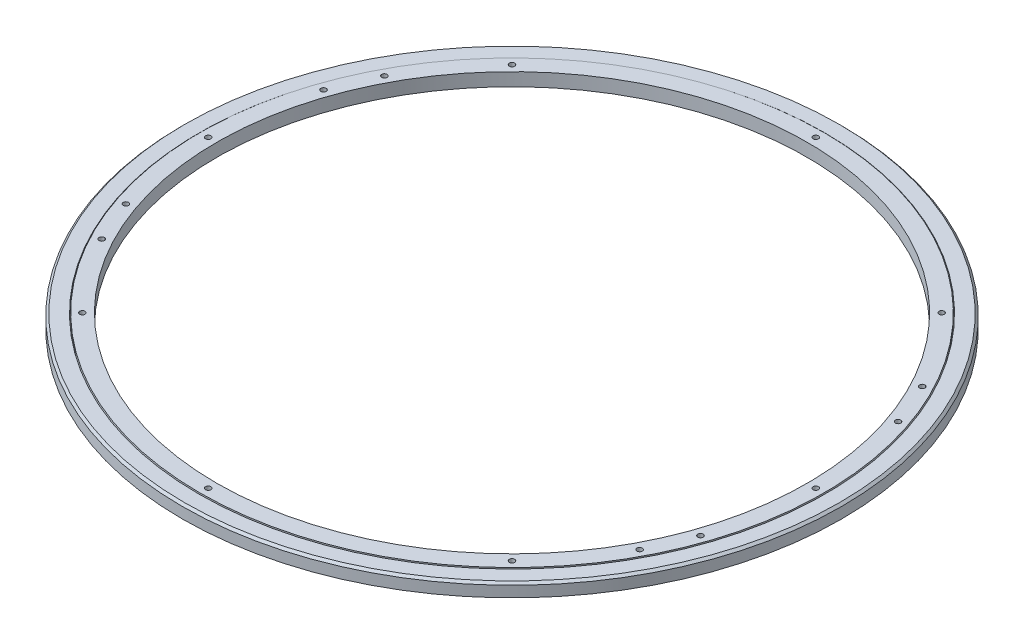
ISO-10303-21;
HEADER;
FILE_DESCRIPTION(('STEP AP214'),'2;1');
FILE_NAME('part.step','',(''),(''),'','','');
FILE_SCHEMA(('AUTOMOTIVE_DESIGN { 1 0 10303 214 1 1 1 1 }'));
ENDSEC;
DATA;
#1=APPLICATION_CONTEXT('core data for automotive mechanical design processes');
#2=APPLICATION_PROTOCOL_DEFINITION('international standard','automotive_design',2000,#1);
#3=PRODUCT_CONTEXT('',#1,'mechanical');
#4=PRODUCT('Part','Part','',(#3));
#5=PRODUCT_RELATED_PRODUCT_CATEGORY('part','',(#4));
#6=PRODUCT_DEFINITION_FORMATION('','',#4);
#7=PRODUCT_DEFINITION_CONTEXT('part definition',#1,'design');
#8=PRODUCT_DEFINITION('design','',#6,#7);
#9=PRODUCT_DEFINITION_SHAPE('','',#8);
#10=(LENGTH_UNIT() NAMED_UNIT(*) SI_UNIT(.MILLI.,.METRE.));
#11=(NAMED_UNIT(*) PLANE_ANGLE_UNIT() SI_UNIT($,.RADIAN.));
#12=(NAMED_UNIT(*) SI_UNIT($,.STERADIAN.) SOLID_ANGLE_UNIT());
#13=UNCERTAINTY_MEASURE_WITH_UNIT(LENGTH_MEASURE(1.E-05),#10,'distance_accuracy_value','');
#14=(GEOMETRIC_REPRESENTATION_CONTEXT(3) GLOBAL_UNCERTAINTY_ASSIGNED_CONTEXT((#13)) GLOBAL_UNIT_ASSIGNED_CONTEXT((#10,
#11,#12)) REPRESENTATION_CONTEXT('',''));
#15=CARTESIAN_POINT('',(0.,0.,0.));
#16=DIRECTION('',(0.,0.,1.));
#17=DIRECTION('',(1.,0.,0.));
#18=AXIS2_PLACEMENT_3D('',#15,#16,#17);
#19=CARTESIAN_POINT('',(0.,11.4758200007945,0.));
#20=DIRECTION('',(0.,1.,0.));
#21=DIRECTION('',(0.,0.,1.));
#22=AXIS2_PLACEMENT_3D('',#19,#20,#21);
#23=CYLINDRICAL_SURFACE('',#22,360.6625);
#24=CARTESIAN_POINT('',(0.,0.,0.));
#25=DIRECTION('',(0.,1.,0.));
#26=DIRECTION('',(0.,0.,1.));
#27=AXIS2_PLACEMENT_3D('',#24,#25,#26);
#28=CIRCLE('',#27,360.6625);
#29=CARTESIAN_POINT('',(0.,0.,360.6625));
#30=VERTEX_POINT('',#29);
#31=EDGE_CURVE('E54',#30,#30,#28,.T.);
#32=ORIENTED_EDGE('',*,*,#31,.T.);
#33=EDGE_LOOP('',(#32));
#34=FACE_BOUND('',#33,.T.);
#35=CARTESIAN_POINT('',(0.,-3.93244185533371,0.));
#36=DIRECTION('',(0.,1.,0.));
#37=DIRECTION('',(0.,0.,1.));
#38=AXIS2_PLACEMENT_3D('',#35,#36,#37);
#39=CIRCLE('',#38,360.6625);
#40=CARTESIAN_POINT('',(0.,-3.93244185533371,360.6625));
#41=VERTEX_POINT('',#40);
#42=EDGE_CURVE('E69',#41,#41,#39,.T.);
#43=ORIENTED_EDGE('',*,*,#42,.F.);
#44=EDGE_LOOP('',(#43));
#45=FACE_BOUND('',#44,.T.);
#46=ADVANCED_FACE('F43',(#34,#45),#23,.F.);
#47=CARTESIAN_POINT('',(-360.6625,0.,0.));
#48=DIRECTION('',(0.,1.,0.));
#49=DIRECTION('',(0.,0.,1.));
#50=AXIS2_PLACEMENT_3D('',#47,#48,#49);
#51=PLANE('',#50);
#52=CARTESIAN_POINT('',(0.,0.,0.));
#53=DIRECTION('',(0.,1.,0.));
#54=DIRECTION('',(0.,0.,1.));
#55=AXIS2_PLACEMENT_3D('',#52,#53,#54);
#56=CIRCLE('',#55,377.4475);
#57=CARTESIAN_POINT('',(0.,0.,377.4475));
#58=VERTEX_POINT('',#57);
#59=EDGE_CURVE('E50',#58,#58,#56,.T.);
#60=ORIENTED_EDGE('',*,*,#59,.T.);
#61=EDGE_LOOP('',(#60));
#62=FACE_BOUND('',#61,.T.);
#63=ORIENTED_EDGE('',*,*,#31,.F.);
#64=EDGE_LOOP('',(#63));
#65=FACE_BOUND('',#64,.T.);
#66=ADVANCED_FACE('F77',(#62,#65),#51,.T.);
#67=CARTESIAN_POINT('',(0.,11.4758200007945,0.));
#68=DIRECTION('',(0.,1.,0.));
#69=DIRECTION('',(0.,0.,1.));
#70=AXIS2_PLACEMENT_3D('',#67,#68,#69);
#71=CYLINDRICAL_SURFACE('',#70,379.9875);
#72=CARTESIAN_POINT('',(0.,-2.53999999999993,0.));
#73=DIRECTION('',(0.,1.,0.));
#74=DIRECTION('',(0.,0.,1.));
#75=AXIS2_PLACEMENT_3D('',#72,#73,#74);
#76=CIRCLE('',#75,379.9875);
#77=CARTESIAN_POINT('',(0.,-2.53999999999993,379.9875));
#78=VERTEX_POINT('',#77);
#79=EDGE_CURVE('E11',#78,#78,#76,.F.);
#80=ORIENTED_EDGE('',*,*,#79,.T.);
#81=EDGE_LOOP('',(#80));
#82=FACE_BOUND('',#81,.T.);
#83=CARTESIAN_POINT('',(0.,-15.08125,0.));
#84=DIRECTION('',(0.,1.,0.));
#85=DIRECTION('',(0.,0.,1.));
#86=AXIS2_PLACEMENT_3D('',#83,#84,#85);
#87=CIRCLE('',#86,379.9875);
#88=CARTESIAN_POINT('',(0.,-15.08125,379.9875));
#89=VERTEX_POINT('',#88);
#90=EDGE_CURVE('E58',#89,#89,#87,.T.);
#91=ORIENTED_EDGE('',*,*,#90,.T.);
#92=EDGE_LOOP('',(#91));
#93=FACE_BOUND('',#92,.T.);
#94=ADVANCED_FACE('F82',(#82,#93),#71,.T.);
#95=CARTESIAN_POINT('',(-360.6625,-15.08125,0.));
#96=DIRECTION('',(0.,-1.,0.));
#97=DIRECTION('',(0.,0.,-1.));
#98=AXIS2_PLACEMENT_3D('',#95,#96,#97);
#99=PLANE('',#98);
#100=CARTESIAN_POINT('',(0.,-15.08125,0.));
#101=DIRECTION('',(0.,1.,0.));
#102=DIRECTION('',(0.,0.,1.));
#103=AXIS2_PLACEMENT_3D('',#100,#101,#102);
#104=CIRCLE('',#103,360.6625);
#105=CARTESIAN_POINT('',(0.,-15.08125,360.6625));
#106=VERTEX_POINT('',#105);
#107=EDGE_CURVE('E63',#106,#106,#104,.T.);
#108=ORIENTED_EDGE('',*,*,#107,.T.);
#109=EDGE_LOOP('',(#108));
#110=FACE_BOUND('',#109,.T.);
#111=ORIENTED_EDGE('',*,*,#90,.F.);
#112=EDGE_LOOP('',(#111));
#113=FACE_BOUND('',#112,.T.);
#114=ADVANCED_FACE('F87',(#110,#113),#99,.T.);
#115=CARTESIAN_POINT('',(0.,11.4758200007945,0.));
#116=DIRECTION('',(0.,1.,0.));
#117=DIRECTION('',(0.,0.,1.));
#118=AXIS2_PLACEMENT_3D('',#115,#116,#117);
#119=CYLINDRICAL_SURFACE('',#118,360.6625);
#120=CARTESIAN_POINT('',(0.,-10.3550581446663,0.));
#121=DIRECTION('',(0.,1.,0.));
#122=DIRECTION('',(0.,0.,1.));
#123=AXIS2_PLACEMENT_3D('',#120,#121,#122);
#124=CIRCLE('',#123,360.6625);
#125=CARTESIAN_POINT('',(0.,-10.3550581446663,360.6625));
#126=VERTEX_POINT('',#125);
#127=EDGE_CURVE('E66',#126,#126,#124,.T.);
#128=ORIENTED_EDGE('',*,*,#127,.T.);
#129=EDGE_LOOP('',(#128));
#130=FACE_BOUND('',#129,.T.);
#131=ORIENTED_EDGE('',*,*,#107,.F.);
#132=EDGE_LOOP('',(#131));
#133=FACE_BOUND('',#132,.T.);
#134=ADVANCED_FACE('F90',(#130,#133),#119,.F.);
#135=CARTESIAN_POINT('',(0.,-7.14374999999999,0.));
#136=DIRECTION('',(0.,1.,0.));
#137=DIRECTION('',(0.,0.,1.));
#138=AXIS2_PLACEMENT_3D('',#135,#136,#137);
#139=TOROIDAL_SURFACE('',#138,360.1625,3.25);
#140=ORIENTED_EDGE('',*,*,#42,.T.);
#141=EDGE_LOOP('',(#140));
#142=FACE_BOUND('',#141,.T.);
#143=ORIENTED_EDGE('',*,*,#127,.F.);
#144=EDGE_LOOP('',(#143));
#145=FACE_BOUND('',#144,.T.);
#146=ADVANCED_FACE('F73',(#142,#145),#139,.F.);
#147=CARTESIAN_POINT('',(0.,0.,0.));
#148=DIRECTION('',(0.,-1.,0.));
#149=DIRECTION('',(0.,0.,-1.));
#150=AXIS2_PLACEMENT_3D('',#147,#148,#149);
#151=CONICAL_SURFACE('',#150,377.4475,0.785398163397448);
#152=ORIENTED_EDGE('',*,*,#79,.F.);
#153=EDGE_LOOP('',(#152));
#154=FACE_BOUND('',#153,.T.);
#155=ORIENTED_EDGE('',*,*,#59,.F.);
#156=EDGE_LOOP('',(#155));
#157=FACE_BOUND('',#156,.T.);
#158=ADVANCED_FACE('F45',(#154,#157),#151,.T.);
#159=CLOSED_SHELL('',(#46,#66,#94,#114,#134,#146,#158));
#160=MANIFOLD_SOLID_BREP('B2',#159);
#161=CARTESIAN_POINT('',(-359.6625,0.793749999999987,0.));
#162=DIRECTION('',(0.,1.,0.));
#163=DIRECTION('',(0.,0.,1.));
#164=AXIS2_PLACEMENT_3D('',#161,#162,#163);
#165=PLANE('',#164);
#166=CARTESIAN_POINT('',(-309.951835338731,0.793750000000015,162.868439780095));
#167=DIRECTION('',(0.,-1.,0.));
#168=DIRECTION('',(0.,0.,-1.));
#169=AXIS2_PLACEMENT_3D('',#166,#167,#168);
#170=CIRCLE('',#169,3.09999999999999);
#171=CARTESIAN_POINT('',(-309.951835338731,0.793750000000015,159.768439780095));
#172=VERTEX_POINT('',#171);
#173=EDGE_CURVE('E292',#172,#172,#170,.T.);
#174=ORIENTED_EDGE('',*,*,#173,.T.);
#175=EDGE_LOOP('',(#174));
#176=FACE_BOUND('',#175,.T.);
#177=CARTESIAN_POINT('',(-331.099210437772,0.793750000000015,113.884071554077));
#178=DIRECTION('',(0.,-1.,0.));
#179=DIRECTION('',(0.,0.,-1.));
#180=AXIS2_PLACEMENT_3D('',#177,#178,#179);
#181=CIRCLE('',#180,3.09999999999999);
#182=CARTESIAN_POINT('',(-331.099210437772,0.793750000000015,110.784071554077));
#183=VERTEX_POINT('',#182);
#184=EDGE_CURVE('E296',#183,#183,#181,.T.);
#185=ORIENTED_EDGE('',*,*,#184,.T.);
#186=EDGE_LOOP('',(#185));
#187=FACE_BOUND('',#186,.T.);
#188=CARTESIAN_POINT('',(309.951835338731,0.793750000000015,162.868439780095));
#189=DIRECTION('',(0.,1.,0.));
#190=DIRECTION('',(0.,0.,-1.));
#191=AXIS2_PLACEMENT_3D('',#188,#189,#190);
#192=CIRCLE('',#191,3.09999999999999);
#193=CARTESIAN_POINT('',(309.951835338731,0.793750000000015,159.768439780095));
#194=VERTEX_POINT('',#193);
#195=EDGE_CURVE('E300',#194,#194,#192,.T.);
#196=ORIENTED_EDGE('',*,*,#195,.F.);
#197=EDGE_LOOP('',(#196));
#198=FACE_BOUND('',#197,.T.);
#199=CARTESIAN_POINT('',(331.099210437772,0.793750000000015,113.884071554077));
#200=DIRECTION('',(0.,1.,0.));
#201=DIRECTION('',(0.,0.,-1.));
#202=AXIS2_PLACEMENT_3D('',#199,#200,#201);
#203=CIRCLE('',#202,3.09999999999999);
#204=CARTESIAN_POINT('',(331.099210437772,0.793750000000015,110.784071554077));
#205=VERTEX_POINT('',#204);
#206=EDGE_CURVE('E304',#205,#205,#203,.T.);
#207=ORIENTED_EDGE('',*,*,#206,.F.);
#208=EDGE_LOOP('',(#207));
#209=FACE_BOUND('',#208,.T.);
#210=CARTESIAN_POINT('',(309.951835338731,0.793750000000015,-162.868439780095));
#211=DIRECTION('',(0.,-1.,0.));
#212=DIRECTION('',(0.,0.,1.));
#213=AXIS2_PLACEMENT_3D('',#210,#211,#212);
#214=CIRCLE('',#213,3.09999999999999);
#215=CARTESIAN_POINT('',(309.951835338731,0.793750000000015,-159.768439780095));
#216=VERTEX_POINT('',#215);
#217=EDGE_CURVE('E308',#216,#216,#214,.T.);
#218=ORIENTED_EDGE('',*,*,#217,.T.);
#219=EDGE_LOOP('',(#218));
#220=FACE_BOUND('',#219,.T.);
#221=CARTESIAN_POINT('',(331.099210437772,0.793750000000015,-113.884071554077));
#222=DIRECTION('',(0.,-1.,0.));
#223=DIRECTION('',(0.,0.,1.));
#224=AXIS2_PLACEMENT_3D('',#221,#222,#223);
#225=CIRCLE('',#224,3.09999999999999);
#226=CARTESIAN_POINT('',(331.099210437772,0.793750000000015,-110.784071554077));
#227=VERTEX_POINT('',#226);
#228=EDGE_CURVE('E312',#227,#227,#225,.T.);
#229=ORIENTED_EDGE('',*,*,#228,.T.);
#230=EDGE_LOOP('',(#229));
#231=FACE_BOUND('',#230,.T.);
#232=CARTESIAN_POINT('',(-309.951835338731,0.793750000000015,-162.868439780095));
#233=DIRECTION('',(0.,1.,0.));
#234=DIRECTION('',(0.,0.,1.));
#235=AXIS2_PLACEMENT_3D('',#232,#233,#234);
#236=CIRCLE('',#235,3.09999999999999);
#237=CARTESIAN_POINT('',(-309.951835338731,0.793750000000015,-159.768439780095));
#238=VERTEX_POINT('',#237);
#239=EDGE_CURVE('E172',#238,#238,#236,.T.);
#240=ORIENTED_EDGE('',*,*,#239,.F.);
#241=EDGE_LOOP('',(#240));
#242=FACE_BOUND('',#241,.T.);
#243=CARTESIAN_POINT('',(-331.099210437772,0.793750000000015,-113.884071554077));
#244=DIRECTION('',(0.,1.,0.));
#245=DIRECTION('',(0.,0.,1.));
#246=AXIS2_PLACEMENT_3D('',#243,#244,#245);
#247=CIRCLE('',#246,3.09999999999999);
#248=CARTESIAN_POINT('',(-331.099210437772,0.793750000000015,-110.784071554077));
#249=VERTEX_POINT('',#248);
#250=EDGE_CURVE('E178',#249,#249,#247,.T.);
#251=ORIENTED_EDGE('',*,*,#250,.F.);
#252=EDGE_LOOP('',(#251));
#253=FACE_BOUND('',#252,.T.);
#254=CARTESIAN_POINT('',(-247.584600597702,0.793749999999987,-247.584600597708));
#255=DIRECTION('',(0.,1.,0.));
#256=DIRECTION('',(0.707106781186539,0.,0.707106781186556));
#257=AXIS2_PLACEMENT_3D('',#254,#255,#256);
#258=CIRCLE('',#257,3.09999999999999);
#259=CARTESIAN_POINT('',(-245.392569576024,0.793749999999987,-245.39256957603));
#260=VERTEX_POINT('',#259);
#261=EDGE_CURVE('E168',#260,#260,#258,.F.);
#262=ORIENTED_EDGE('',*,*,#261,.T.);
#263=EDGE_LOOP('',(#262));
#264=FACE_BOUND('',#263,.T.);
#265=CARTESIAN_POINT('',(-350.1375,0.793749999999987,-3.66749564183756E-12));
#266=DIRECTION('',(0.,1.,0.));
#267=DIRECTION('',(1.,0.,0.));
#268=AXIS2_PLACEMENT_3D('',#265,#266,#267);
#269=CIRCLE('',#268,3.09999999999999);
#270=CARTESIAN_POINT('',(-347.0375,0.793749999999987,-3.63502486538632E-12));
#271=VERTEX_POINT('',#270);
#272=EDGE_CURVE('E213',#271,#271,#269,.F.);
#273=ORIENTED_EDGE('',*,*,#272,.T.);
#274=EDGE_LOOP('',(#273));
#275=FACE_BOUND('',#274,.T.);
#276=CARTESIAN_POINT('',(-247.584600597707,0.793749999999987,247.584600597703));
#277=DIRECTION('',(0.,1.,0.));
#278=DIRECTION('',(0.707106781186554,0.,-0.707106781186541));
#279=AXIS2_PLACEMENT_3D('',#276,#277,#278);
#280=CIRCLE('',#279,3.09999999999999);
#281=CARTESIAN_POINT('',(-245.392569576029,0.793749999999987,245.392569576024));
#282=VERTEX_POINT('',#281);
#283=EDGE_CURVE('E219',#282,#282,#280,.F.);
#284=ORIENTED_EDGE('',*,*,#283,.T.);
#285=EDGE_LOOP('',(#284));
#286=FACE_BOUND('',#285,.T.);
#287=CARTESIAN_POINT('',(-2.44499709455838E-12,0.793749999999987,350.1375));
#288=DIRECTION('',(0.,1.,0.));
#289=DIRECTION('',(0.,0.,-1.));
#290=AXIS2_PLACEMENT_3D('',#287,#288,#289);
#291=CIRCLE('',#290,3.09999999999999);
#292=CARTESIAN_POINT('',(-2.42334991025755E-12,0.793749999999987,347.0375));
#293=VERTEX_POINT('',#292);
#294=EDGE_CURVE('E225',#293,#293,#291,.F.);
#295=ORIENTED_EDGE('',*,*,#294,.T.);
#296=EDGE_LOOP('',(#295));
#297=FACE_BOUND('',#296,.T.);
#298=CARTESIAN_POINT('',(247.584600597704,0.793749999999987,247.584600597706));
#299=DIRECTION('',(0.,1.,0.));
#300=DIRECTION('',(-0.707106781186544,0.,-0.707106781186551));
#301=AXIS2_PLACEMENT_3D('',#298,#299,#300);
#302=CIRCLE('',#301,3.09999999999999);
#303=CARTESIAN_POINT('',(245.392569576025,0.793749999999987,245.392569576028));
#304=VERTEX_POINT('',#303);
#305=EDGE_CURVE('E231',#304,#304,#302,.F.);
#306=ORIENTED_EDGE('',*,*,#305,.T.);
#307=EDGE_LOOP('',(#306));
#308=FACE_BOUND('',#307,.T.);
#309=CARTESIAN_POINT('',(350.1375,0.793749999999987,1.22249854727919E-12));
#310=DIRECTION('',(0.,1.,0.));
#311=DIRECTION('',(-1.,0.,0.));
#312=AXIS2_PLACEMENT_3D('',#309,#310,#311);
#313=CIRCLE('',#312,3.09999999999999);
#314=CARTESIAN_POINT('',(347.0375,0.793749999999987,1.21167495512877E-12));
#315=VERTEX_POINT('',#314);
#316=EDGE_CURVE('E237',#315,#315,#313,.F.);
#317=ORIENTED_EDGE('',*,*,#316,.T.);
#318=EDGE_LOOP('',(#317));
#319=FACE_BOUND('',#318,.T.);
#320=CARTESIAN_POINT('',(247.584600597705,0.793749999999987,-247.584600597704));
#321=DIRECTION('',(0.,1.,0.));
#322=DIRECTION('',(-0.707106781186549,0.,0.707106781186546));
#323=AXIS2_PLACEMENT_3D('',#320,#321,#322);
#324=CIRCLE('',#323,3.09999999999999);
#325=CARTESIAN_POINT('',(245.392569576027,0.793749999999987,-245.392569576026));
#326=VERTEX_POINT('',#325);
#327=EDGE_CURVE('E243',#326,#326,#324,.F.);
#328=ORIENTED_EDGE('',*,*,#327,.T.);
#329=EDGE_LOOP('',(#328));
#330=FACE_BOUND('',#329,.T.);
#331=CARTESIAN_POINT('',(0.,0.793749999999987,-350.1375));
#332=DIRECTION('',(0.,1.,0.));
#333=DIRECTION('',(0.,0.,1.));
#334=AXIS2_PLACEMENT_3D('',#331,#332,#333);
#335=CIRCLE('',#334,3.09999999999999);
#336=CARTESIAN_POINT('',(0.,0.793749999999987,-347.0375));
#337=VERTEX_POINT('',#336);
#338=EDGE_CURVE('E252',#337,#337,#335,.F.);
#339=ORIENTED_EDGE('',*,*,#338,.T.);
#340=EDGE_LOOP('',(#339));
#341=FACE_BOUND('',#340,.T.);
#342=CARTESIAN_POINT('',(0.,0.793750000000015,0.));
#343=DIRECTION('',(0.,1.,0.));
#344=DIRECTION('',(0.,0.,1.));
#345=AXIS2_PLACEMENT_3D('',#342,#343,#344);
#346=CIRCLE('',#345,359.6625);
#347=CARTESIAN_POINT('',(0.,0.793750000000015,359.6625));
#348=VERTEX_POINT('',#347);
#349=EDGE_CURVE('E42',#348,#348,#346,.T.);
#350=ORIENTED_EDGE('',*,*,#349,.T.);
#351=EDGE_LOOP('',(#350));
#352=FACE_BOUND('',#351,.T.);
#353=CARTESIAN_POINT('',(0.,0.793749999999961,0.));
#354=DIRECTION('',(0.,1.,0.));
#355=DIRECTION('',(0.,0.,1.));
#356=AXIS2_PLACEMENT_3D('',#353,#354,#355);
#357=CIRCLE('',#356,340.3375);
#358=CARTESIAN_POINT('',(0.,0.793749999999961,340.3375));
#359=VERTEX_POINT('',#358);
#360=EDGE_CURVE('E255',#359,#359,#357,.T.);
#361=ORIENTED_EDGE('',*,*,#360,.F.);
#362=EDGE_LOOP('',(#361));
#363=FACE_BOUND('',#362,.T.);
#364=ADVANCED_FACE('F150',(#176,#187,#198,#209,#220,#231,#242,#253,#264,#275,#286,#297,#308,
#319,#330,#341,#352,#363),#165,.T.);
#365=CARTESIAN_POINT('',(0.,11.4758200007945,0.));
#366=DIRECTION('',(0.,1.,0.));
#367=DIRECTION('',(0.,0.,1.));
#368=AXIS2_PLACEMENT_3D('',#365,#366,#367);
#369=CYLINDRICAL_SURFACE('',#368,359.6625);
#370=CARTESIAN_POINT('',(0.,-3.9324418553337,0.));
#371=DIRECTION('',(0.,1.,0.));
#372=DIRECTION('',(0.,0.,1.));
#373=AXIS2_PLACEMENT_3D('',#370,#371,#372);
#374=CIRCLE('',#373,359.6625);
#375=CARTESIAN_POINT('',(0.,-3.9324418553337,359.6625));
#376=VERTEX_POINT('',#375);
#377=EDGE_CURVE('E157',#376,#376,#374,.T.);
#378=ORIENTED_EDGE('',*,*,#377,.T.);
#379=EDGE_LOOP('',(#378));
#380=FACE_BOUND('',#379,.T.);
#381=ORIENTED_EDGE('',*,*,#349,.F.);
#382=EDGE_LOOP('',(#381));
#383=FACE_BOUND('',#382,.T.);
#384=ADVANCED_FACE('F281',(#380,#383),#369,.T.);
#385=CARTESIAN_POINT('',(0.,-7.14374999999999,0.));
#386=DIRECTION('',(0.,1.,0.));
#387=DIRECTION('',(0.,0.,1.));
#388=AXIS2_PLACEMENT_3D('',#385,#386,#387);
#389=TOROIDAL_SURFACE('',#388,360.1625,3.24999999999999);
#390=CARTESIAN_POINT('',(0.,-10.3550581446663,0.));
#391=DIRECTION('',(0.,1.,0.));
#392=DIRECTION('',(0.,0.,1.));
#393=AXIS2_PLACEMENT_3D('',#390,#391,#392);
#394=CIRCLE('',#393,359.6625);
#395=CARTESIAN_POINT('',(0.,-10.3550581446663,359.6625));
#396=VERTEX_POINT('',#395);
#397=EDGE_CURVE('E162',#396,#396,#394,.T.);
#398=ORIENTED_EDGE('',*,*,#397,.T.);
#399=EDGE_LOOP('',(#398));
#400=FACE_BOUND('',#399,.T.);
#401=ORIENTED_EDGE('',*,*,#377,.F.);
#402=EDGE_LOOP('',(#401));
#403=FACE_BOUND('',#402,.T.);
#404=ADVANCED_FACE('F266',(#400,#403),#389,.F.);
#405=CARTESIAN_POINT('',(0.,11.4758200007945,0.));
#406=DIRECTION('',(0.,1.,0.));
#407=DIRECTION('',(0.,0.,1.));
#408=AXIS2_PLACEMENT_3D('',#405,#406,#407);
#409=CYLINDRICAL_SURFACE('',#408,359.6625);
#410=CARTESIAN_POINT('',(0.,-14.2875,0.));
#411=DIRECTION('',(0.,1.,0.));
#412=DIRECTION('',(0.,0.,1.));
#413=AXIS2_PLACEMENT_3D('',#410,#411,#412);
#414=CIRCLE('',#413,359.6625);
#415=CARTESIAN_POINT('',(0.,-14.2875,359.6625));
#416=VERTEX_POINT('',#415);
#417=EDGE_CURVE('E261',#416,#416,#414,.T.);
#418=ORIENTED_EDGE('',*,*,#417,.T.);
#419=EDGE_LOOP('',(#418));
#420=FACE_BOUND('',#419,.T.);
#421=ORIENTED_EDGE('',*,*,#397,.F.);
#422=EDGE_LOOP('',(#421));
#423=FACE_BOUND('',#422,.T.);
#424=ADVANCED_FACE('F269',(#420,#423),#409,.T.);
#425=CARTESIAN_POINT('',(-359.6625,-14.2875,0.));
#426=DIRECTION('',(0.,-1.,0.));
#427=DIRECTION('',(0.,0.,-1.));
#428=AXIS2_PLACEMENT_3D('',#425,#426,#427);
#429=PLANE('',#428);
#430=CARTESIAN_POINT('',(-309.951835338731,-14.2875,162.868439780095));
#431=DIRECTION('',(0.,-1.,0.));
#432=DIRECTION('',(0.,0.,-1.));
#433=AXIS2_PLACEMENT_3D('',#430,#431,#432);
#434=CIRCLE('',#433,3.09999999999999);
#435=CARTESIAN_POINT('',(-309.951835338731,-14.2875,159.768439780095));
#436=VERTEX_POINT('',#435);
#437=EDGE_CURVE('E443',#436,#436,#434,.T.);
#438=ORIENTED_EDGE('',*,*,#437,.F.);
#439=EDGE_LOOP('',(#438));
#440=FACE_BOUND('',#439,.T.);
#441=CARTESIAN_POINT('',(-331.099210437772,-14.2875,113.884071554077));
#442=DIRECTION('',(0.,-1.,0.));
#443=DIRECTION('',(0.,0.,-1.));
#444=AXIS2_PLACEMENT_3D('',#441,#442,#443);
#445=CIRCLE('',#444,3.09999999999999);
#446=CARTESIAN_POINT('',(-331.099210437772,-14.2875,110.784071554077));
#447=VERTEX_POINT('',#446);
#448=EDGE_CURVE('E444',#447,#447,#445,.T.);
#449=ORIENTED_EDGE('',*,*,#448,.F.);
#450=EDGE_LOOP('',(#449));
#451=FACE_BOUND('',#450,.T.);
#452=CARTESIAN_POINT('',(309.951835338731,-14.2875,162.868439780095));
#453=DIRECTION('',(0.,1.,0.));
#454=DIRECTION('',(0.,0.,-1.));
#455=AXIS2_PLACEMENT_3D('',#452,#453,#454);
#456=CIRCLE('',#455,3.09999999999999);
#457=CARTESIAN_POINT('',(309.951835338731,-14.2875,159.768439780095));
#458=VERTEX_POINT('',#457);
#459=EDGE_CURVE('E452',#458,#458,#456,.T.);
#460=ORIENTED_EDGE('',*,*,#459,.T.);
#461=EDGE_LOOP('',(#460));
#462=FACE_BOUND('',#461,.T.);
#463=CARTESIAN_POINT('',(331.099210437772,-14.2875,113.884071554077));
#464=DIRECTION('',(0.,1.,0.));
#465=DIRECTION('',(0.,0.,-1.));
#466=AXIS2_PLACEMENT_3D('',#463,#464,#465);
#467=CIRCLE('',#466,3.09999999999999);
#468=CARTESIAN_POINT('',(331.099210437772,-14.2875,110.784071554077));
#469=VERTEX_POINT('',#468);
#470=EDGE_CURVE('E453',#469,#469,#467,.T.);
#471=ORIENTED_EDGE('',*,*,#470,.T.);
#472=EDGE_LOOP('',(#471));
#473=FACE_BOUND('',#472,.T.);
#474=CARTESIAN_POINT('',(309.951835338731,-14.2875,-162.868439780095));
#475=DIRECTION('',(0.,-1.,0.));
#476=DIRECTION('',(0.,0.,1.));
#477=AXIS2_PLACEMENT_3D('',#474,#475,#476);
#478=CIRCLE('',#477,3.09999999999999);
#479=CARTESIAN_POINT('',(309.951835338731,-14.2875,-159.768439780095));
#480=VERTEX_POINT('',#479);
#481=EDGE_CURVE('E183',#480,#480,#478,.T.);
#482=ORIENTED_EDGE('',*,*,#481,.F.);
#483=EDGE_LOOP('',(#482));
#484=FACE_BOUND('',#483,.T.);
#485=CARTESIAN_POINT('',(331.099210437772,-14.2875,-113.884071554077));
#486=DIRECTION('',(0.,-1.,0.));
#487=DIRECTION('',(0.,0.,1.));
#488=AXIS2_PLACEMENT_3D('',#485,#486,#487);
#489=CIRCLE('',#488,3.09999999999999);
#490=CARTESIAN_POINT('',(331.099210437772,-14.2875,-110.784071554077));
#491=VERTEX_POINT('',#490);
#492=EDGE_CURVE('E186',#491,#491,#489,.T.);
#493=ORIENTED_EDGE('',*,*,#492,.F.);
#494=EDGE_LOOP('',(#493));
#495=FACE_BOUND('',#494,.T.);
#496=CARTESIAN_POINT('',(-309.951835338731,-14.2875,-162.868439780095));
#497=DIRECTION('',(0.,-1.,0.));
#498=DIRECTION('',(0.,0.,-1.));
#499=AXIS2_PLACEMENT_3D('',#496,#497,#498);
#500=CIRCLE('',#499,3.09999999999999);
#501=CARTESIAN_POINT('',(-309.951835338731,-14.2875,-165.968439780095));
#502=VERTEX_POINT('',#501);
#503=EDGE_CURVE('E153',#502,#502,#500,.T.);
#504=ORIENTED_EDGE('',*,*,#503,.F.);
#505=EDGE_LOOP('',(#504));
#506=FACE_BOUND('',#505,.T.);
#507=CARTESIAN_POINT('',(-331.099210437772,-14.2875,-113.884071554077));
#508=DIRECTION('',(0.,-1.,0.));
#509=DIRECTION('',(0.,0.,-1.));
#510=AXIS2_PLACEMENT_3D('',#507,#508,#509);
#511=CIRCLE('',#510,3.09999999999999);
#512=CARTESIAN_POINT('',(-331.099210437772,-14.2875,-116.984071554077));
#513=VERTEX_POINT('',#512);
#514=EDGE_CURVE('E170',#513,#513,#511,.T.);
#515=ORIENTED_EDGE('',*,*,#514,.F.);
#516=EDGE_LOOP('',(#515));
#517=FACE_BOUND('',#516,.T.);
#518=CARTESIAN_POINT('',(133.991820299735,-14.2875,-323.484869814669));
#519=DIRECTION('',(0.,-1.,0.));
#520=DIRECTION('',(-1.,0.,0.));
#521=AXIS2_PLACEMENT_3D('',#518,#519,#520);
#522=CIRCLE('',#521,2.35000000000001);
#523=CARTESIAN_POINT('',(131.641820299735,-14.2875,-323.484869814669));
#524=VERTEX_POINT('',#523);
#525=EDGE_CURVE('E176',#524,#524,#522,.T.);
#526=ORIENTED_EDGE('',*,*,#525,.F.);
#527=EDGE_LOOP('',(#526));
#528=FACE_BOUND('',#527,.T.);
#529=CARTESIAN_POINT('',(-323.48486981467,-14.2875,-133.991820299734));
#530=DIRECTION('',(0.,-1.,0.));
#531=DIRECTION('',(0.,0.,1.));
#532=AXIS2_PLACEMENT_3D('',#529,#530,#531);
#533=CIRCLE('',#532,2.35000000000001);
#534=CARTESIAN_POINT('',(-323.48486981467,-14.2875,-131.641820299734));
#535=VERTEX_POINT('',#534);
#536=EDGE_CURVE('E194',#535,#535,#533,.T.);
#537=ORIENTED_EDGE('',*,*,#536,.F.);
#538=EDGE_LOOP('',(#537));
#539=FACE_BOUND('',#538,.T.);
#540=CARTESIAN_POINT('',(-133.991820299733,-14.2875,323.48486981467));
#541=DIRECTION('',(0.,-1.,0.));
#542=DIRECTION('',(1.,0.,0.));
#543=AXIS2_PLACEMENT_3D('',#540,#541,#542);
#544=CIRCLE('',#543,2.35000000000001);
#545=CARTESIAN_POINT('',(-131.641820299733,-14.2875,323.48486981467));
#546=VERTEX_POINT('',#545);
#547=EDGE_CURVE('E200',#546,#546,#544,.T.);
#548=ORIENTED_EDGE('',*,*,#547,.F.);
#549=EDGE_LOOP('',(#548));
#550=FACE_BOUND('',#549,.T.);
#551=CARTESIAN_POINT('',(323.484869814671,-14.2875,133.991820299732));
#552=DIRECTION('',(0.,-1.,0.));
#553=DIRECTION('',(0.,0.,-1.));
#554=AXIS2_PLACEMENT_3D('',#551,#552,#553);
#555=CIRCLE('',#554,2.35000000000001);
#556=CARTESIAN_POINT('',(323.484869814671,-14.2875,131.641820299732));
#557=VERTEX_POINT('',#556);
#558=EDGE_CURVE('E166',#557,#557,#555,.T.);
#559=ORIENTED_EDGE('',*,*,#558,.F.);
#560=EDGE_LOOP('',(#559));
#561=FACE_BOUND('',#560,.T.);
#562=CARTESIAN_POINT('',(-247.584600597702,-14.2875,-247.584600597708));
#563=DIRECTION('',(0.,-1.,0.));
#564=DIRECTION('',(-0.707106781186539,0.,-0.707106781186556));
#565=AXIS2_PLACEMENT_3D('',#562,#563,#564);
#566=CIRCLE('',#565,3.09999999999999);
#567=CARTESIAN_POINT('',(-249.77663161938,-14.2875,-249.776631619386));
#568=VERTEX_POINT('',#567);
#569=EDGE_CURVE('E210',#568,#568,#566,.F.);
#570=ORIENTED_EDGE('',*,*,#569,.T.);
#571=EDGE_LOOP('',(#570));
#572=FACE_BOUND('',#571,.T.);
#573=CARTESIAN_POINT('',(-350.1375,-14.2875,-3.66749564183756E-12));
#574=DIRECTION('',(0.,-1.,0.));
#575=DIRECTION('',(-1.,0.,0.));
#576=AXIS2_PLACEMENT_3D('',#573,#574,#575);
#577=CIRCLE('',#576,3.09999999999999);
#578=CARTESIAN_POINT('',(-353.2375,-14.2875,-3.6999664182888E-12));
#579=VERTEX_POINT('',#578);
#580=EDGE_CURVE('E216',#579,#579,#577,.F.);
#581=ORIENTED_EDGE('',*,*,#580,.T.);
#582=EDGE_LOOP('',(#581));
#583=FACE_BOUND('',#582,.T.);
#584=CARTESIAN_POINT('',(-247.584600597707,-14.2875,247.584600597703));
#585=DIRECTION('',(0.,-1.,0.));
#586=DIRECTION('',(-0.707106781186554,0.,0.707106781186541));
#587=AXIS2_PLACEMENT_3D('',#584,#585,#586);
#588=CIRCLE('',#587,3.09999999999999);
#589=CARTESIAN_POINT('',(-249.776631619385,-14.2875,249.776631619381));
#590=VERTEX_POINT('',#589);
#591=EDGE_CURVE('E222',#590,#590,#588,.F.);
#592=ORIENTED_EDGE('',*,*,#591,.T.);
#593=EDGE_LOOP('',(#592));
#594=FACE_BOUND('',#593,.T.);
#595=CARTESIAN_POINT('',(-2.44499709455838E-12,-14.2875,350.1375));
#596=DIRECTION('',(0.,-1.,0.));
#597=DIRECTION('',(0.,0.,1.));
#598=AXIS2_PLACEMENT_3D('',#595,#596,#597);
#599=CIRCLE('',#598,3.09999999999999);
#600=CARTESIAN_POINT('',(-2.4666442788592E-12,-14.2875,353.2375));
#601=VERTEX_POINT('',#600);
#602=EDGE_CURVE('E228',#601,#601,#599,.F.);
#603=ORIENTED_EDGE('',*,*,#602,.T.);
#604=EDGE_LOOP('',(#603));
#605=FACE_BOUND('',#604,.T.);
#606=CARTESIAN_POINT('',(247.584600597704,-14.2875,247.584600597706));
#607=DIRECTION('',(0.,-1.,0.));
#608=DIRECTION('',(0.707106781186544,0.,0.707106781186551));
#609=AXIS2_PLACEMENT_3D('',#606,#607,#608);
#610=CIRCLE('',#609,3.09999999999999);
#611=CARTESIAN_POINT('',(249.776631619382,-14.2875,249.776631619385));
#612=VERTEX_POINT('',#611);
#613=EDGE_CURVE('E234',#612,#612,#610,.F.);
#614=ORIENTED_EDGE('',*,*,#613,.T.);
#615=EDGE_LOOP('',(#614));
#616=FACE_BOUND('',#615,.T.);
#617=CARTESIAN_POINT('',(350.1375,-14.2875,1.22249854727919E-12));
#618=DIRECTION('',(0.,-1.,0.));
#619=DIRECTION('',(1.,0.,0.));
#620=AXIS2_PLACEMENT_3D('',#617,#618,#619);
#621=CIRCLE('',#620,3.09999999999999);
#622=CARTESIAN_POINT('',(353.2375,-14.2875,1.2333221394296E-12));
#623=VERTEX_POINT('',#622);
#624=EDGE_CURVE('E240',#623,#623,#621,.F.);
#625=ORIENTED_EDGE('',*,*,#624,.T.);
#626=EDGE_LOOP('',(#625));
#627=FACE_BOUND('',#626,.T.);
#628=CARTESIAN_POINT('',(247.584600597705,-14.2875,-247.584600597704));
#629=DIRECTION('',(0.,-1.,0.));
#630=DIRECTION('',(0.707106781186549,0.,-0.707106781186546));
#631=AXIS2_PLACEMENT_3D('',#628,#629,#630);
#632=CIRCLE('',#631,3.09999999999999);
#633=CARTESIAN_POINT('',(249.776631619384,-14.2875,-249.776631619383));
#634=VERTEX_POINT('',#633);
#635=EDGE_CURVE('E246',#634,#634,#632,.F.);
#636=ORIENTED_EDGE('',*,*,#635,.T.);
#637=EDGE_LOOP('',(#636));
#638=FACE_BOUND('',#637,.T.);
#639=CARTESIAN_POINT('',(0.,-14.2875,-350.1375));
#640=DIRECTION('',(0.,-1.,0.));
#641=DIRECTION('',(0.,0.,-1.));
#642=AXIS2_PLACEMENT_3D('',#639,#640,#641);
#643=CIRCLE('',#642,3.09999999999999);
#644=CARTESIAN_POINT('',(0.,-14.2875,-353.2375));
#645=VERTEX_POINT('',#644);
#646=EDGE_CURVE('E249',#645,#645,#643,.F.);
#647=ORIENTED_EDGE('',*,*,#646,.T.);
#648=EDGE_LOOP('',(#647));
#649=FACE_BOUND('',#648,.T.);
#650=CARTESIAN_POINT('',(0.,-14.2875,0.));
#651=DIRECTION('',(0.,1.,0.));
#652=DIRECTION('',(0.,0.,1.));
#653=AXIS2_PLACEMENT_3D('',#650,#651,#652);
#654=CIRCLE('',#653,340.3375);
#655=CARTESIAN_POINT('',(0.,-14.2875,340.3375));
#656=VERTEX_POINT('',#655);
#657=EDGE_CURVE('E258',#656,#656,#654,.T.);
#658=ORIENTED_EDGE('',*,*,#657,.T.);
#659=EDGE_LOOP('',(#658));
#660=FACE_BOUND('',#659,.T.);
#661=ORIENTED_EDGE('',*,*,#417,.F.);
#662=EDGE_LOOP('',(#661));
#663=FACE_BOUND('',#662,.T.);
#664=ADVANCED_FACE('F271',(#440,#451,#462,#473,#484,#495,#506,#517,#528,#539,#550,#561,#572,
#583,#594,#605,#616,#627,#638,#649,#660,#663),#429,.T.);
#665=CARTESIAN_POINT('',(0.,11.4758200007945,0.));
#666=DIRECTION('',(0.,1.,0.));
#667=DIRECTION('',(0.,0.,1.));
#668=AXIS2_PLACEMENT_3D('',#665,#666,#667);
#669=CYLINDRICAL_SURFACE('',#668,340.3375);
#670=ORIENTED_EDGE('',*,*,#360,.T.);
#671=EDGE_LOOP('',(#670));
#672=FACE_BOUND('',#671,.T.);
#673=ORIENTED_EDGE('',*,*,#657,.F.);
#674=EDGE_LOOP('',(#673));
#675=FACE_BOUND('',#674,.T.);
#676=ADVANCED_FACE('F278',(#672,#675),#669,.F.);
#677=CARTESIAN_POINT('',(0.,0.794750000000016,-350.1375));
#678=DIRECTION('',(0.,-1.,0.));
#679=DIRECTION('',(0.,0.,-1.));
#680=AXIS2_PLACEMENT_3D('',#677,#678,#679);
#681=CYLINDRICAL_SURFACE('',#680,3.09999999999999);
#682=ORIENTED_EDGE('',*,*,#338,.F.);
#683=EDGE_LOOP('',(#682));
#684=FACE_BOUND('',#683,.T.);
#685=ORIENTED_EDGE('',*,*,#646,.F.);
#686=EDGE_LOOP('',(#685));
#687=FACE_BOUND('',#686,.T.);
#688=ADVANCED_FACE('F336',(#684,#687),#681,.F.);
#689=CARTESIAN_POINT('',(247.584600597705,0.794750000000016,-247.584600597704));
#690=DIRECTION('',(0.,-1.,0.));
#691=DIRECTION('',(0.707106781186549,0.,-0.707106781186546));
#692=AXIS2_PLACEMENT_3D('',#689,#690,#691);
#693=CYLINDRICAL_SURFACE('',#692,3.09999999999999);
#694=ORIENTED_EDGE('',*,*,#327,.F.);
#695=EDGE_LOOP('',(#694));
#696=FACE_BOUND('',#695,.T.);
#697=ORIENTED_EDGE('',*,*,#635,.F.);
#698=EDGE_LOOP('',(#697));
#699=FACE_BOUND('',#698,.T.);
#700=ADVANCED_FACE('F345',(#696,#699),#693,.F.);
#701=CARTESIAN_POINT('',(350.1375,0.794750000000016,1.22249854727919E-12));
#702=DIRECTION('',(0.,-1.,0.));
#703=DIRECTION('',(1.,0.,0.));
#704=AXIS2_PLACEMENT_3D('',#701,#702,#703);
#705=CYLINDRICAL_SURFACE('',#704,3.09999999999999);
#706=ORIENTED_EDGE('',*,*,#316,.F.);
#707=EDGE_LOOP('',(#706));
#708=FACE_BOUND('',#707,.T.);
#709=ORIENTED_EDGE('',*,*,#624,.F.);
#710=EDGE_LOOP('',(#709));
#711=FACE_BOUND('',#710,.T.);
#712=ADVANCED_FACE('F351',(#708,#711),#705,.F.);
#713=CARTESIAN_POINT('',(247.584600597704,0.794750000000016,247.584600597706));
#714=DIRECTION('',(0.,-1.,0.));
#715=DIRECTION('',(0.707106781186544,0.,0.707106781186551));
#716=AXIS2_PLACEMENT_3D('',#713,#714,#715);
#717=CYLINDRICAL_SURFACE('',#716,3.09999999999999);
#718=ORIENTED_EDGE('',*,*,#305,.F.);
#719=EDGE_LOOP('',(#718));
#720=FACE_BOUND('',#719,.T.);
#721=ORIENTED_EDGE('',*,*,#613,.F.);
#722=EDGE_LOOP('',(#721));
#723=FACE_BOUND('',#722,.T.);
#724=ADVANCED_FACE('F355',(#720,#723),#717,.F.);
#725=CARTESIAN_POINT('',(-2.44499709455838E-12,0.794750000000016,350.1375));
#726=DIRECTION('',(0.,-1.,0.));
#727=DIRECTION('',(0.,0.,1.));
#728=AXIS2_PLACEMENT_3D('',#725,#726,#727);
#729=CYLINDRICAL_SURFACE('',#728,3.09999999999999);
#730=ORIENTED_EDGE('',*,*,#294,.F.);
#731=EDGE_LOOP('',(#730));
#732=FACE_BOUND('',#731,.T.);
#733=ORIENTED_EDGE('',*,*,#602,.F.);
#734=EDGE_LOOP('',(#733));
#735=FACE_BOUND('',#734,.T.);
#736=ADVANCED_FACE('F359',(#732,#735),#729,.F.);
#737=CARTESIAN_POINT('',(-247.584600597707,0.794750000000016,247.584600597703));
#738=DIRECTION('',(0.,-1.,0.));
#739=DIRECTION('',(-0.707106781186554,0.,0.707106781186541));
#740=AXIS2_PLACEMENT_3D('',#737,#738,#739);
#741=CYLINDRICAL_SURFACE('',#740,3.09999999999999);
#742=ORIENTED_EDGE('',*,*,#283,.F.);
#743=EDGE_LOOP('',(#742));
#744=FACE_BOUND('',#743,.T.);
#745=ORIENTED_EDGE('',*,*,#591,.F.);
#746=EDGE_LOOP('',(#745));
#747=FACE_BOUND('',#746,.T.);
#748=ADVANCED_FACE('F363',(#744,#747),#741,.F.);
#749=CARTESIAN_POINT('',(-350.1375,0.794750000000016,-3.66749564183756E-12));
#750=DIRECTION('',(0.,-1.,0.));
#751=DIRECTION('',(-1.,0.,0.));
#752=AXIS2_PLACEMENT_3D('',#749,#750,#751);
#753=CYLINDRICAL_SURFACE('',#752,3.09999999999999);
#754=ORIENTED_EDGE('',*,*,#272,.F.);
#755=EDGE_LOOP('',(#754));
#756=FACE_BOUND('',#755,.T.);
#757=ORIENTED_EDGE('',*,*,#580,.F.);
#758=EDGE_LOOP('',(#757));
#759=FACE_BOUND('',#758,.T.);
#760=ADVANCED_FACE('F367',(#756,#759),#753,.F.);
#761=CARTESIAN_POINT('',(-247.584600597702,0.794750000000016,-247.584600597708));
#762=DIRECTION('',(0.,-1.,0.));
#763=DIRECTION('',(-0.707106781186539,0.,-0.707106781186556));
#764=AXIS2_PLACEMENT_3D('',#761,#762,#763);
#765=CYLINDRICAL_SURFACE('',#764,3.09999999999999);
#766=ORIENTED_EDGE('',*,*,#261,.F.);
#767=EDGE_LOOP('',(#766));
#768=FACE_BOUND('',#767,.T.);
#769=ORIENTED_EDGE('',*,*,#569,.F.);
#770=EDGE_LOOP('',(#769));
#771=FACE_BOUND('',#770,.T.);
#772=ADVANCED_FACE('F371',(#768,#771),#765,.F.);
#773=CARTESIAN_POINT('',(323.484869814671,-15.08125,133.991820299732));
#774=DIRECTION('',(0.,1.,0.));
#775=DIRECTION('',(0.,0.,1.));
#776=AXIS2_PLACEMENT_3D('',#773,#774,#775);
#777=CYLINDRICAL_SURFACE('',#776,2.35000000000001);
#778=ORIENTED_EDGE('',*,*,#558,.T.);
#779=EDGE_LOOP('',(#778));
#780=FACE_BOUND('',#779,.T.);
#781=CARTESIAN_POINT('',(323.484869814671,0.,133.991820299732));
#782=DIRECTION('',(0.,1.,0.));
#783=DIRECTION('',(0.,0.,1.));
#784=AXIS2_PLACEMENT_3D('',#781,#782,#783);
#785=CIRCLE('',#784,2.35000000000001);
#786=CARTESIAN_POINT('',(323.484869814671,0.,136.341820299732));
#787=VERTEX_POINT('',#786);
#788=EDGE_CURVE('E169',#787,#787,#785,.T.);
#789=ORIENTED_EDGE('',*,*,#788,.T.);
#790=EDGE_LOOP('',(#789));
#791=FACE_BOUND('',#790,.T.);
#792=ADVANCED_FACE('F375',(#780,#791),#777,.F.);
#793=CARTESIAN_POINT('',(323.484869814671,0.,133.991820299732));
#794=DIRECTION('',(0.,1.,0.));
#795=DIRECTION('',(0.,0.,1.));
#796=AXIS2_PLACEMENT_3D('',#793,#794,#795);
#797=PLANE('',#796);
#798=ORIENTED_EDGE('',*,*,#788,.F.);
#799=EDGE_LOOP('',(#798));
#800=FACE_BOUND('',#799,.T.);
#801=ADVANCED_FACE('F379',(#800),#797,.F.);
#802=CARTESIAN_POINT('',(-133.991820299733,-15.08125,323.48486981467));
#803=DIRECTION('',(0.,1.,0.));
#804=DIRECTION('',(-1.,0.,0.));
#805=AXIS2_PLACEMENT_3D('',#802,#803,#804);
#806=CYLINDRICAL_SURFACE('',#805,2.35000000000001);
#807=ORIENTED_EDGE('',*,*,#547,.T.);
#808=EDGE_LOOP('',(#807));
#809=FACE_BOUND('',#808,.T.);
#810=CARTESIAN_POINT('',(-133.991820299733,0.,323.48486981467));
#811=DIRECTION('',(0.,1.,0.));
#812=DIRECTION('',(-1.,0.,0.));
#813=AXIS2_PLACEMENT_3D('',#810,#811,#812);
#814=CIRCLE('',#813,2.35000000000001);
#815=CARTESIAN_POINT('',(-136.341820299733,0.,323.48486981467));
#816=VERTEX_POINT('',#815);
#817=EDGE_CURVE('E203',#816,#816,#814,.T.);
#818=ORIENTED_EDGE('',*,*,#817,.T.);
#819=EDGE_LOOP('',(#818));
#820=FACE_BOUND('',#819,.T.);
#821=ADVANCED_FACE('F383',(#809,#820),#806,.F.);
#822=CARTESIAN_POINT('',(-133.991820299733,0.,323.48486981467));
#823=DIRECTION('',(0.,1.,0.));
#824=DIRECTION('',(-1.,0.,0.));
#825=AXIS2_PLACEMENT_3D('',#822,#823,#824);
#826=PLANE('',#825);
#827=ORIENTED_EDGE('',*,*,#817,.F.);
#828=EDGE_LOOP('',(#827));
#829=FACE_BOUND('',#828,.T.);
#830=ADVANCED_FACE('F387',(#829),#826,.F.);
#831=CARTESIAN_POINT('',(-323.48486981467,-15.08125,-133.991820299734));
#832=DIRECTION('',(0.,1.,0.));
#833=DIRECTION('',(0.,0.,-1.));
#834=AXIS2_PLACEMENT_3D('',#831,#832,#833);
#835=CYLINDRICAL_SURFACE('',#834,2.35000000000001);
#836=ORIENTED_EDGE('',*,*,#536,.T.);
#837=EDGE_LOOP('',(#836));
#838=FACE_BOUND('',#837,.T.);
#839=CARTESIAN_POINT('',(-323.48486981467,0.,-133.991820299734));
#840=DIRECTION('',(0.,1.,0.));
#841=DIRECTION('',(0.,0.,-1.));
#842=AXIS2_PLACEMENT_3D('',#839,#840,#841);
#843=CIRCLE('',#842,2.35000000000001);
#844=CARTESIAN_POINT('',(-323.48486981467,0.,-136.341820299734));
#845=VERTEX_POINT('',#844);
#846=EDGE_CURVE('E197',#845,#845,#843,.T.);
#847=ORIENTED_EDGE('',*,*,#846,.T.);
#848=EDGE_LOOP('',(#847));
#849=FACE_BOUND('',#848,.T.);
#850=ADVANCED_FACE('F391',(#838,#849),#835,.F.);
#851=CARTESIAN_POINT('',(-323.48486981467,0.,-133.991820299734));
#852=DIRECTION('',(0.,1.,0.));
#853=DIRECTION('',(0.,0.,-1.));
#854=AXIS2_PLACEMENT_3D('',#851,#852,#853);
#855=PLANE('',#854);
#856=ORIENTED_EDGE('',*,*,#846,.F.);
#857=EDGE_LOOP('',(#856));
#858=FACE_BOUND('',#857,.T.);
#859=ADVANCED_FACE('F395',(#858),#855,.F.);
#860=CARTESIAN_POINT('',(133.991820299735,-15.08125,-323.484869814669));
#861=DIRECTION('',(0.,1.,0.));
#862=DIRECTION('',(1.,0.,0.));
#863=AXIS2_PLACEMENT_3D('',#860,#861,#862);
#864=CYLINDRICAL_SURFACE('',#863,2.35000000000001);
#865=ORIENTED_EDGE('',*,*,#525,.T.);
#866=EDGE_LOOP('',(#865));
#867=FACE_BOUND('',#866,.T.);
#868=CARTESIAN_POINT('',(133.991820299735,0.,-323.484869814669));
#869=DIRECTION('',(0.,1.,0.));
#870=DIRECTION('',(1.,0.,0.));
#871=AXIS2_PLACEMENT_3D('',#868,#869,#870);
#872=CIRCLE('',#871,2.35000000000001);
#873=CARTESIAN_POINT('',(136.341820299735,0.,-323.484869814669));
#874=VERTEX_POINT('',#873);
#875=EDGE_CURVE('E191',#874,#874,#872,.T.);
#876=ORIENTED_EDGE('',*,*,#875,.T.);
#877=EDGE_LOOP('',(#876));
#878=FACE_BOUND('',#877,.T.);
#879=ADVANCED_FACE('F399',(#867,#878),#864,.F.);
#880=CARTESIAN_POINT('',(133.991820299735,0.,-323.484869814669));
#881=DIRECTION('',(0.,1.,0.));
#882=DIRECTION('',(1.,0.,0.));
#883=AXIS2_PLACEMENT_3D('',#880,#881,#882);
#884=PLANE('',#883);
#885=ORIENTED_EDGE('',*,*,#875,.F.);
#886=EDGE_LOOP('',(#885));
#887=FACE_BOUND('',#886,.T.);
#888=ADVANCED_FACE('F403',(#887),#884,.F.);
#889=CARTESIAN_POINT('',(-331.099210437772,-15.08125,-113.884071554077));
#890=DIRECTION('',(0.,1.,0.));
#891=DIRECTION('',(0.,0.,1.));
#892=AXIS2_PLACEMENT_3D('',#889,#890,#891);
#893=CYLINDRICAL_SURFACE('',#892,3.09999999999999);
#894=ORIENTED_EDGE('',*,*,#514,.T.);
#895=EDGE_LOOP('',(#894));
#896=FACE_BOUND('',#895,.T.);
#897=ORIENTED_EDGE('',*,*,#250,.T.);
#898=EDGE_LOOP('',(#897));
#899=FACE_BOUND('',#898,.T.);
#900=ADVANCED_FACE('F407',(#896,#899),#893,.F.);
#901=CARTESIAN_POINT('',(-309.951835338731,-15.08125,-162.868439780095));
#902=DIRECTION('',(0.,1.,0.));
#903=DIRECTION('',(0.,0.,1.));
#904=AXIS2_PLACEMENT_3D('',#901,#902,#903);
#905=CYLINDRICAL_SURFACE('',#904,3.09999999999999);
#906=ORIENTED_EDGE('',*,*,#503,.T.);
#907=EDGE_LOOP('',(#906));
#908=FACE_BOUND('',#907,.T.);
#909=ORIENTED_EDGE('',*,*,#239,.T.);
#910=EDGE_LOOP('',(#909));
#911=FACE_BOUND('',#910,.T.);
#912=ADVANCED_FACE('F411',(#908,#911),#905,.F.);
#913=CARTESIAN_POINT('',(331.099210437772,-14.2875,-113.884071554077));
#914=DIRECTION('',(0.,1.,0.));
#915=DIRECTION('',(0.,0.,1.));
#916=AXIS2_PLACEMENT_3D('',#913,#914,#915);
#917=CYLINDRICAL_SURFACE('',#916,3.09999999999999);
#918=ORIENTED_EDGE('',*,*,#492,.T.);
#919=EDGE_LOOP('',(#918));
#920=FACE_BOUND('',#919,.T.);
#921=ORIENTED_EDGE('',*,*,#228,.F.);
#922=EDGE_LOOP('',(#921));
#923=FACE_BOUND('',#922,.T.);
#924=ADVANCED_FACE('F414',(#920,#923),#917,.F.);
#925=CARTESIAN_POINT('',(309.951835338731,-14.2875,-162.868439780095));
#926=DIRECTION('',(0.,1.,0.));
#927=DIRECTION('',(0.,0.,1.));
#928=AXIS2_PLACEMENT_3D('',#925,#926,#927);
#929=CYLINDRICAL_SURFACE('',#928,3.09999999999999);
#930=ORIENTED_EDGE('',*,*,#481,.T.);
#931=EDGE_LOOP('',(#930));
#932=FACE_BOUND('',#931,.T.);
#933=ORIENTED_EDGE('',*,*,#217,.F.);
#934=EDGE_LOOP('',(#933));
#935=FACE_BOUND('',#934,.T.);
#936=ADVANCED_FACE('F418',(#932,#935),#929,.F.);
#937=CARTESIAN_POINT('',(331.099210437772,-14.2875,113.884071554077));
#938=DIRECTION('',(0.,1.,0.));
#939=DIRECTION('',(0.,0.,1.));
#940=AXIS2_PLACEMENT_3D('',#937,#938,#939);
#941=CYLINDRICAL_SURFACE('',#940,3.09999999999999);
#942=ORIENTED_EDGE('',*,*,#470,.F.);
#943=EDGE_LOOP('',(#942));
#944=FACE_BOUND('',#943,.T.);
#945=ORIENTED_EDGE('',*,*,#206,.T.);
#946=EDGE_LOOP('',(#945));
#947=FACE_BOUND('',#946,.T.);
#948=ADVANCED_FACE('F422',(#944,#947),#941,.F.);
#949=CARTESIAN_POINT('',(309.951835338731,-14.2875,162.868439780095));
#950=DIRECTION('',(0.,1.,0.));
#951=DIRECTION('',(0.,0.,1.));
#952=AXIS2_PLACEMENT_3D('',#949,#950,#951);
#953=CYLINDRICAL_SURFACE('',#952,3.09999999999999);
#954=ORIENTED_EDGE('',*,*,#459,.F.);
#955=EDGE_LOOP('',(#954));
#956=FACE_BOUND('',#955,.T.);
#957=ORIENTED_EDGE('',*,*,#195,.T.);
#958=EDGE_LOOP('',(#957));
#959=FACE_BOUND('',#958,.T.);
#960=ADVANCED_FACE('F426',(#956,#959),#953,.F.);
#961=CARTESIAN_POINT('',(-331.099210437772,-14.2875,113.884071554077));
#962=DIRECTION('',(0.,1.,0.));
#963=DIRECTION('',(0.,0.,1.));
#964=AXIS2_PLACEMENT_3D('',#961,#962,#963);
#965=CYLINDRICAL_SURFACE('',#964,3.09999999999999);
#966=ORIENTED_EDGE('',*,*,#448,.T.);
#967=EDGE_LOOP('',(#966));
#968=FACE_BOUND('',#967,.T.);
#969=ORIENTED_EDGE('',*,*,#184,.F.);
#970=EDGE_LOOP('',(#969));
#971=FACE_BOUND('',#970,.T.);
#972=ADVANCED_FACE('F430',(#968,#971),#965,.F.);
#973=CARTESIAN_POINT('',(-309.951835338731,-14.2875,162.868439780095));
#974=DIRECTION('',(0.,1.,0.));
#975=DIRECTION('',(0.,0.,1.));
#976=AXIS2_PLACEMENT_3D('',#973,#974,#975);
#977=CYLINDRICAL_SURFACE('',#976,3.09999999999999);
#978=ORIENTED_EDGE('',*,*,#437,.T.);
#979=EDGE_LOOP('',(#978));
#980=FACE_BOUND('',#979,.T.);
#981=ORIENTED_EDGE('',*,*,#173,.F.);
#982=EDGE_LOOP('',(#981));
#983=FACE_BOUND('',#982,.T.);
#984=ADVANCED_FACE('F434',(#980,#983),#977,.F.);
#985=CLOSED_SHELL('',(#364,#384,#404,#424,#664,#676,#688,#700,#712,#724,#736,#748,#760,#772,
#792,#801,#821,#830,#850,#859,#879,#888,#900,#912,#924,#936,#948,#960,#972,#984));
#986=MANIFOLD_SOLID_BREP('B6',#985);
#987=ADVANCED_BREP_SHAPE_REPRESENTATION('',(#18,#160,#986),#14);
#988=SHAPE_DEFINITION_REPRESENTATION(#9,#987);
ENDSEC;
END-ISO-10303-21;
